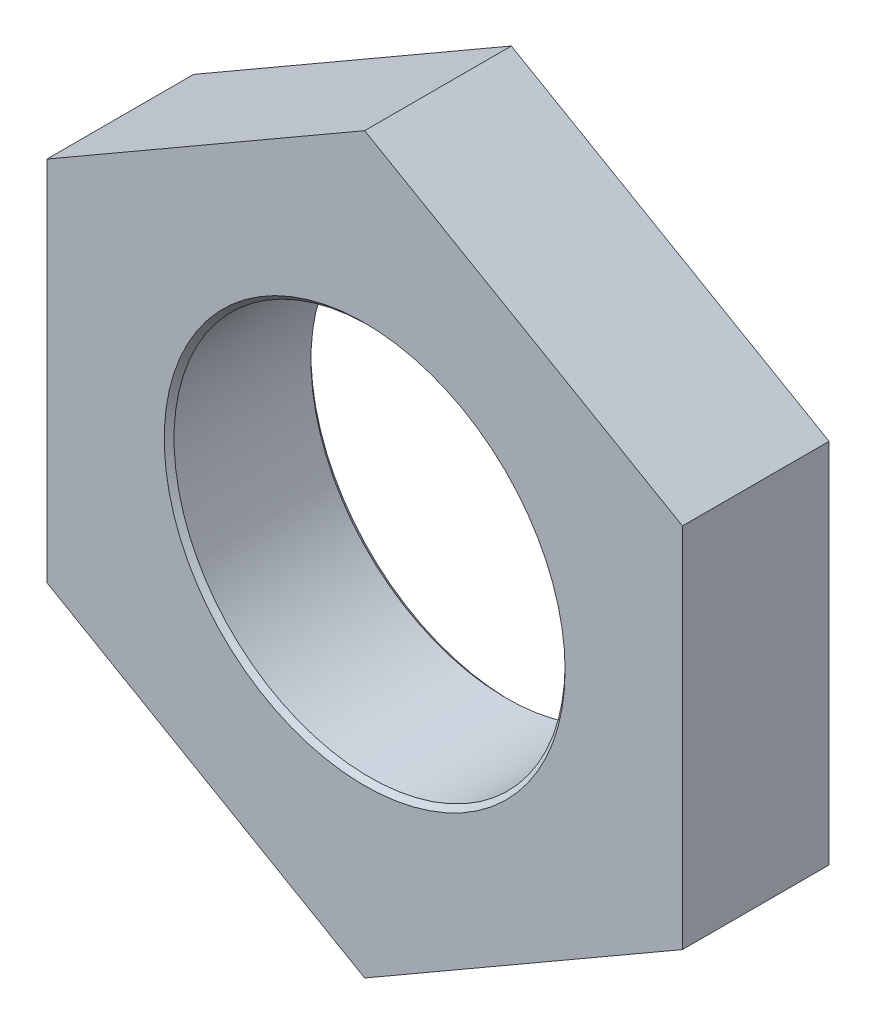
ISO-10303-21;
HEADER;
FILE_DESCRIPTION(('STEP AP214'),'2;1');
FILE_NAME('part.step','',(''),(''),'','','');
FILE_SCHEMA(('AUTOMOTIVE_DESIGN { 1 0 10303 214 1 1 1 1 }'));
ENDSEC;
DATA;
#1=APPLICATION_CONTEXT('core data for automotive mechanical design processes');
#2=APPLICATION_PROTOCOL_DEFINITION('international standard','automotive_design',2000,#1);
#3=PRODUCT_CONTEXT('',#1,'mechanical');
#4=PRODUCT('Part','Part','',(#3));
#5=PRODUCT_RELATED_PRODUCT_CATEGORY('part','',(#4));
#6=PRODUCT_DEFINITION_FORMATION('','',#4);
#7=PRODUCT_DEFINITION_CONTEXT('part definition',#1,'design');
#8=PRODUCT_DEFINITION('design','',#6,#7);
#9=PRODUCT_DEFINITION_SHAPE('','',#8);
#10=(LENGTH_UNIT() NAMED_UNIT(*) SI_UNIT(.MILLI.,.METRE.));
#11=(NAMED_UNIT(*) PLANE_ANGLE_UNIT() SI_UNIT($,.RADIAN.));
#12=(NAMED_UNIT(*) SI_UNIT($,.STERADIAN.) SOLID_ANGLE_UNIT());
#13=UNCERTAINTY_MEASURE_WITH_UNIT(LENGTH_MEASURE(1.E-05),#10,'distance_accuracy_value','');
#14=(GEOMETRIC_REPRESENTATION_CONTEXT(3) GLOBAL_UNCERTAINTY_ASSIGNED_CONTEXT((#13)) GLOBAL_UNIT_ASSIGNED_CONTEXT((#10,
#11,#12)) REPRESENTATION_CONTEXT('',''));
#15=CARTESIAN_POINT('',(0.,0.,0.));
#16=DIRECTION('',(0.,0.,1.));
#17=DIRECTION('',(1.,0.,0.));
#18=AXIS2_PLACEMENT_3D('',#15,#16,#17);
#19=CARTESIAN_POINT('',(6.49999999999997,3.75277674973265,-3.));
#20=DIRECTION('',(0.499999999999995,0.866025403784441,0.));
#21=DIRECTION('',(-0.866025403784441,0.499999999999995,0.));
#22=AXIS2_PLACEMENT_3D('',#19,#20,#21);
#23=PLANE('',#22);
#24=DIRECTION('',(-0.866025403784442,0.499999999999995,0.));
#25=VECTOR('',#24,1.);
#26=CARTESIAN_POINT('',(6.49999999999997,3.75277674973265,0.));
#27=LINE('',#26,#25);
#28=CARTESIAN_POINT('',(6.49999999999997,3.75277674973265,0.));
#29=VERTEX_POINT('',#28);
#30=CARTESIAN_POINT('',(0.,7.50555349946516,0.));
#31=VERTEX_POINT('',#30);
#32=EDGE_CURVE('E136',#29,#31,#27,.T.);
#33=ORIENTED_EDGE('',*,*,#32,.F.);
#34=DIRECTION('',(0.,0.,1.));
#35=VECTOR('',#34,1.);
#36=CARTESIAN_POINT('',(6.49999999999997,3.75277674973265,-3.));
#37=LINE('',#36,#35);
#38=CARTESIAN_POINT('',(6.49999999999997,3.75277674973265,-3.));
#39=VERTEX_POINT('',#38);
#40=EDGE_CURVE('E65',#39,#29,#37,.T.);
#41=ORIENTED_EDGE('',*,*,#40,.F.);
#42=DIRECTION('',(-0.866025403784442,0.499999999999995,0.));
#43=VECTOR('',#42,1.);
#44=CARTESIAN_POINT('',(6.49999999999997,3.75277674973265,-3.));
#45=LINE('',#44,#43);
#46=CARTESIAN_POINT('',(0.,7.50555349946516,-3.));
#47=VERTEX_POINT('',#46);
#48=EDGE_CURVE('E151',#39,#47,#45,.T.);
#49=ORIENTED_EDGE('',*,*,#48,.T.);
#50=DIRECTION('',(0.,0.,1.));
#51=VECTOR('',#50,1.);
#52=CARTESIAN_POINT('',(0.,7.50555349946516,-3.));
#53=LINE('',#52,#51);
#54=EDGE_CURVE('E100',#47,#31,#53,.T.);
#55=ORIENTED_EDGE('',*,*,#54,.T.);
#56=EDGE_LOOP('',(#33,#41,#49,#55));
#57=FACE_BOUND('',#56,.T.);
#58=ADVANCED_FACE('F47',(#57),#23,.T.);
#59=CARTESIAN_POINT('',(6.50000000000005,-3.75277674973252,-3.));
#60=DIRECTION('',(1.,0.,0.));
#61=DIRECTION('',(0.,1.,0.));
#62=AXIS2_PLACEMENT_3D('',#59,#60,#61);
#63=PLANE('',#62);
#64=DIRECTION('',(0.,1.,0.));
#65=VECTOR('',#64,1.);
#66=CARTESIAN_POINT('',(6.50000000000005,-3.75277674973252,0.));
#67=LINE('',#66,#65);
#68=CARTESIAN_POINT('',(6.50000000000005,-3.75277674973252,0.));
#69=VERTEX_POINT('',#68);
#70=EDGE_CURVE('E148',#69,#29,#67,.T.);
#71=ORIENTED_EDGE('',*,*,#70,.F.);
#72=DIRECTION('',(0.,0.,1.));
#73=VECTOR('',#72,1.);
#74=CARTESIAN_POINT('',(6.50000000000005,-3.75277674973252,-3.));
#75=LINE('',#74,#73);
#76=CARTESIAN_POINT('',(6.50000000000005,-3.75277674973252,-3.));
#77=VERTEX_POINT('',#76);
#78=EDGE_CURVE('E88',#77,#69,#75,.T.);
#79=ORIENTED_EDGE('',*,*,#78,.F.);
#80=DIRECTION('',(0.,1.,0.));
#81=VECTOR('',#80,1.);
#82=CARTESIAN_POINT('',(6.50000000000005,-3.75277674973252,-3.));
#83=LINE('',#82,#81);
#84=EDGE_CURVE('E126',#77,#39,#83,.T.);
#85=ORIENTED_EDGE('',*,*,#84,.T.);
#86=ORIENTED_EDGE('',*,*,#40,.T.);
#87=EDGE_LOOP('',(#71,#79,#85,#86));
#88=FACE_BOUND('',#87,.T.);
#89=ADVANCED_FACE('F195',(#88),#63,.T.);
#90=CARTESIAN_POINT('',(0.,-7.50555349946515,-3.));
#91=DIRECTION('',(0.500000000000007,-0.866025403784434,0.));
#92=DIRECTION('',(0.866025403784435,0.500000000000007,0.));
#93=AXIS2_PLACEMENT_3D('',#90,#91,#92);
#94=PLANE('',#93);
#95=DIRECTION('',(0.866025403784435,0.500000000000007,0.));
#96=VECTOR('',#95,1.);
#97=CARTESIAN_POINT('',(0.,-7.50555349946515,0.));
#98=LINE('',#97,#96);
#99=CARTESIAN_POINT('',(0.,-7.50555349946515,0.));
#100=VERTEX_POINT('',#99);
#101=EDGE_CURVE('E113',#100,#69,#98,.T.);
#102=ORIENTED_EDGE('',*,*,#101,.F.);
#103=DIRECTION('',(0.,0.,1.));
#104=VECTOR('',#103,1.);
#105=CARTESIAN_POINT('',(0.,-7.50555349946515,-3.));
#106=LINE('',#105,#104);
#107=CARTESIAN_POINT('',(0.,-7.50555349946515,-3.));
#108=VERTEX_POINT('',#107);
#109=EDGE_CURVE('E108',#108,#100,#106,.T.);
#110=ORIENTED_EDGE('',*,*,#109,.F.);
#111=DIRECTION('',(0.866025403784435,0.500000000000007,0.));
#112=VECTOR('',#111,1.);
#113=CARTESIAN_POINT('',(0.,-7.50555349946515,-3.));
#114=LINE('',#113,#112);
#115=EDGE_CURVE('E111',#108,#77,#114,.T.);
#116=ORIENTED_EDGE('',*,*,#115,.T.);
#117=ORIENTED_EDGE('',*,*,#78,.T.);
#118=EDGE_LOOP('',(#102,#110,#116,#117));
#119=FACE_BOUND('',#118,.T.);
#120=ADVANCED_FACE('F110',(#119),#94,.T.);
#121=CARTESIAN_POINT('',(-6.5,-3.75277674973261,-3.));
#122=DIRECTION('',(-0.499999999999995,-0.866025403784442,0.));
#123=DIRECTION('',(0.866025403784442,-0.499999999999995,0.));
#124=AXIS2_PLACEMENT_3D('',#121,#122,#123);
#125=PLANE('',#124);
#126=DIRECTION('',(0.866025403784441,-0.499999999999995,0.));
#127=VECTOR('',#126,1.);
#128=CARTESIAN_POINT('',(-6.5,-3.75277674973261,0.));
#129=LINE('',#128,#127);
#130=CARTESIAN_POINT('',(-6.5,-3.75277674973261,0.));
#131=VERTEX_POINT('',#130);
#132=EDGE_CURVE('E145',#131,#100,#129,.T.);
#133=ORIENTED_EDGE('',*,*,#132,.F.);
#134=DIRECTION('',(0.,0.,1.));
#135=VECTOR('',#134,1.);
#136=CARTESIAN_POINT('',(-6.5,-3.75277674973261,-3.));
#137=LINE('',#136,#135);
#138=CARTESIAN_POINT('',(-6.5,-3.75277674973261,-3.));
#139=VERTEX_POINT('',#138);
#140=EDGE_CURVE('E118',#139,#131,#137,.T.);
#141=ORIENTED_EDGE('',*,*,#140,.F.);
#142=DIRECTION('',(0.866025403784441,-0.499999999999995,0.));
#143=VECTOR('',#142,1.);
#144=CARTESIAN_POINT('',(-6.5,-3.75277674973261,-3.));
#145=LINE('',#144,#143);
#146=EDGE_CURVE('E124',#139,#108,#145,.T.);
#147=ORIENTED_EDGE('',*,*,#146,.T.);
#148=ORIENTED_EDGE('',*,*,#109,.T.);
#149=EDGE_LOOP('',(#133,#141,#147,#148));
#150=FACE_BOUND('',#149,.T.);
#151=ADVANCED_FACE('F128',(#150),#125,.T.);
#152=CARTESIAN_POINT('',(-6.50000000000002,3.75277674973256,-3.));
#153=DIRECTION('',(-1.,0.,0.));
#154=DIRECTION('',(0.,-1.,0.));
#155=AXIS2_PLACEMENT_3D('',#152,#153,#154);
#156=PLANE('',#155);
#157=DIRECTION('',(0.,-1.,0.));
#158=VECTOR('',#157,1.);
#159=CARTESIAN_POINT('',(-6.50000000000002,3.75277674973256,0.));
#160=LINE('',#159,#158);
#161=CARTESIAN_POINT('',(-6.50000000000002,3.75277674973256,0.));
#162=VERTEX_POINT('',#161);
#163=EDGE_CURVE('E142',#162,#131,#160,.T.);
#164=ORIENTED_EDGE('',*,*,#163,.F.);
#165=DIRECTION('',(0.,0.,1.));
#166=VECTOR('',#165,1.);
#167=CARTESIAN_POINT('',(-6.50000000000002,3.75277674973256,-3.));
#168=LINE('',#167,#166);
#169=CARTESIAN_POINT('',(-6.50000000000002,3.75277674973256,-3.));
#170=VERTEX_POINT('',#169);
#171=EDGE_CURVE('E156',#170,#162,#168,.T.);
#172=ORIENTED_EDGE('',*,*,#171,.F.);
#173=DIRECTION('',(0.,-1.,0.));
#174=VECTOR('',#173,1.);
#175=CARTESIAN_POINT('',(-6.50000000000002,3.75277674973256,-3.));
#176=LINE('',#175,#174);
#177=EDGE_CURVE('E129',#170,#139,#176,.T.);
#178=ORIENTED_EDGE('',*,*,#177,.T.);
#179=ORIENTED_EDGE('',*,*,#140,.T.);
#180=EDGE_LOOP('',(#164,#172,#178,#179));
#181=FACE_BOUND('',#180,.T.);
#182=ADVANCED_FACE('F192',(#181),#156,.T.);
#183=CARTESIAN_POINT('',(0.,7.50555349946516,-3.));
#184=DIRECTION('',(-0.500000000000001,0.866025403784438,0.));
#185=DIRECTION('',(-0.866025403784438,-0.500000000000001,0.));
#186=AXIS2_PLACEMENT_3D('',#183,#184,#185);
#187=PLANE('',#186);
#188=DIRECTION('',(-0.866025403784438,-0.500000000000001,0.));
#189=VECTOR('',#188,1.);
#190=CARTESIAN_POINT('',(0.,7.50555349946516,0.));
#191=LINE('',#190,#189);
#192=EDGE_CURVE('E139',#31,#162,#191,.T.);
#193=ORIENTED_EDGE('',*,*,#192,.F.);
#194=ORIENTED_EDGE('',*,*,#54,.F.);
#195=DIRECTION('',(-0.866025403784438,-0.500000000000001,0.));
#196=VECTOR('',#195,1.);
#197=CARTESIAN_POINT('',(0.,7.50555349946516,-3.));
#198=LINE('',#197,#196);
#199=EDGE_CURVE('E131',#47,#170,#198,.T.);
#200=ORIENTED_EDGE('',*,*,#199,.T.);
#201=ORIENTED_EDGE('',*,*,#171,.T.);
#202=EDGE_LOOP('',(#193,#194,#200,#201));
#203=FACE_BOUND('',#202,.T.);
#204=ADVANCED_FACE('F185',(#203),#187,.T.);
#205=CARTESIAN_POINT('',(0.,0.,-3.));
#206=DIRECTION('',(0.,0.,1.));
#207=DIRECTION('',(1.,0.,0.));
#208=AXIS2_PLACEMENT_3D('',#205,#206,#207);
#209=PLANE('',#208);
#210=CARTESIAN_POINT('',(0.,0.,-3.));
#211=DIRECTION('',(0.,0.,1.));
#212=DIRECTION('',(1.,0.,0.));
#213=AXIS2_PLACEMENT_3D('',#210,#211,#212);
#214=CIRCLE('',#213,4.1);
#215=CARTESIAN_POINT('',(4.1,0.,-3.));
#216=VERTEX_POINT('',#215);
#217=EDGE_CURVE('E11',#216,#216,#214,.T.);
#218=ORIENTED_EDGE('',*,*,#217,.T.);
#219=EDGE_LOOP('',(#218));
#220=FACE_BOUND('',#219,.T.);
#221=ORIENTED_EDGE('',*,*,#48,.F.);
#222=ORIENTED_EDGE('',*,*,#84,.F.);
#223=ORIENTED_EDGE('',*,*,#115,.F.);
#224=ORIENTED_EDGE('',*,*,#146,.F.);
#225=ORIENTED_EDGE('',*,*,#177,.F.);
#226=ORIENTED_EDGE('',*,*,#199,.F.);
#227=EDGE_LOOP('',(#221,#222,#223,#224,#225,#226));
#228=FACE_BOUND('',#227,.T.);
#229=ADVANCED_FACE('F122',(#220,#228),#209,.F.);
#230=CARTESIAN_POINT('',(0.,0.,0.));
#231=DIRECTION('',(0.,0.,1.));
#232=DIRECTION('',(1.,0.,0.));
#233=AXIS2_PLACEMENT_3D('',#230,#231,#232);
#234=PLANE('',#233);
#235=CARTESIAN_POINT('',(0.,0.,0.));
#236=DIRECTION('',(0.,0.,1.));
#237=DIRECTION('',(1.,0.,0.));
#238=AXIS2_PLACEMENT_3D('',#235,#236,#237);
#239=CIRCLE('',#238,4.1);
#240=CARTESIAN_POINT('',(4.1,0.,0.));
#241=VERTEX_POINT('',#240);
#242=EDGE_CURVE('E57',#241,#241,#239,.F.);
#243=ORIENTED_EDGE('',*,*,#242,.T.);
#244=EDGE_LOOP('',(#243));
#245=FACE_BOUND('',#244,.T.);
#246=ORIENTED_EDGE('',*,*,#32,.T.);
#247=ORIENTED_EDGE('',*,*,#192,.T.);
#248=ORIENTED_EDGE('',*,*,#163,.T.);
#249=ORIENTED_EDGE('',*,*,#132,.T.);
#250=ORIENTED_EDGE('',*,*,#101,.T.);
#251=ORIENTED_EDGE('',*,*,#70,.T.);
#252=EDGE_LOOP('',(#246,#247,#248,#249,#250,#251));
#253=FACE_BOUND('',#252,.T.);
#254=ADVANCED_FACE('F166',(#245,#253),#234,.T.);
#255=CARTESIAN_POINT('',(0.,0.,-3.));
#256=DIRECTION('',(0.,0.,1.));
#257=DIRECTION('',(1.,0.,0.));
#258=AXIS2_PLACEMENT_3D('',#255,#256,#257);
#259=CYLINDRICAL_SURFACE('',#258,4.);
#260=CARTESIAN_POINT('',(0.,0.,-0.0999999999999959));
#261=DIRECTION('',(0.,0.,1.));
#262=DIRECTION('',(1.,0.,0.));
#263=AXIS2_PLACEMENT_3D('',#260,#261,#262);
#264=CIRCLE('',#263,4.);
#265=CARTESIAN_POINT('',(4.,0.,-0.0999999999999959));
#266=VERTEX_POINT('',#265);
#267=EDGE_CURVE('E161',#266,#266,#264,.T.);
#268=ORIENTED_EDGE('',*,*,#267,.T.);
#269=EDGE_LOOP('',(#268));
#270=FACE_BOUND('',#269,.T.);
#271=CARTESIAN_POINT('',(0.,0.,-2.9));
#272=DIRECTION('',(0.,0.,1.));
#273=DIRECTION('',(1.,0.,0.));
#274=AXIS2_PLACEMENT_3D('',#271,#272,#273);
#275=CIRCLE('',#274,4.);
#276=CARTESIAN_POINT('',(4.,0.,-2.9));
#277=VERTEX_POINT('',#276);
#278=EDGE_CURVE('E153',#277,#277,#275,.F.);
#279=ORIENTED_EDGE('',*,*,#278,.T.);
#280=EDGE_LOOP('',(#279));
#281=FACE_BOUND('',#280,.T.);
#282=ADVANCED_FACE('F172',(#270,#281),#259,.F.);
#283=CARTESIAN_POINT('',(0.,0.,-0.0999999999999959));
#284=DIRECTION('',(0.,0.,1.));
#285=DIRECTION('',(1.,0.,0.));
#286=AXIS2_PLACEMENT_3D('',#283,#284,#285);
#287=CONICAL_SURFACE('',#286,4.,0.785398163397448);
#288=ORIENTED_EDGE('',*,*,#242,.F.);
#289=EDGE_LOOP('',(#288));
#290=FACE_BOUND('',#289,.T.);
#291=ORIENTED_EDGE('',*,*,#267,.F.);
#292=EDGE_LOOP('',(#291));
#293=FACE_BOUND('',#292,.T.);
#294=ADVANCED_FACE('F169',(#290,#293),#287,.F.);
#295=CARTESIAN_POINT('',(0.,0.,-3.));
#296=DIRECTION('',(0.,0.,-1.));
#297=DIRECTION('',(-1.,0.,0.));
#298=AXIS2_PLACEMENT_3D('',#295,#296,#297);
#299=CONICAL_SURFACE('',#298,4.1,0.78539816339744);
#300=ORIENTED_EDGE('',*,*,#278,.F.);
#301=EDGE_LOOP('',(#300));
#302=FACE_BOUND('',#301,.T.);
#303=ORIENTED_EDGE('',*,*,#217,.F.);
#304=EDGE_LOOP('',(#303));
#305=FACE_BOUND('',#304,.T.);
#306=ADVANCED_FACE('F50',(#302,#305),#299,.F.);
#307=CLOSED_SHELL('',(#58,#89,#120,#151,#182,#204,#229,#254,#282,#294,#306));
#308=MANIFOLD_SOLID_BREP('B2',#307);
#309=ADVANCED_BREP_SHAPE_REPRESENTATION('',(#18,#308),#14);
#310=SHAPE_DEFINITION_REPRESENTATION(#9,#309);
ENDSEC;
END-ISO-10303-21;
